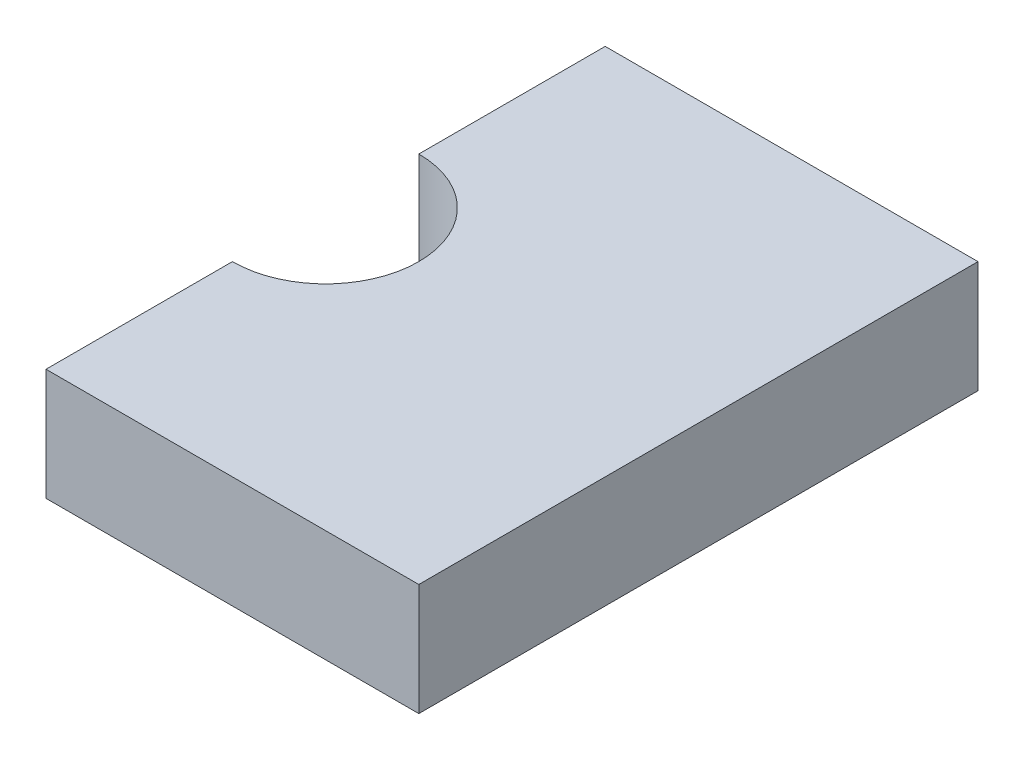
ISO-10303-21;
HEADER;
FILE_DESCRIPTION(('STEP AP214'),'2;1');
FILE_NAME('part.step','',(''),(''),'','','');
FILE_SCHEMA(('AUTOMOTIVE_DESIGN { 1 0 10303 214 1 1 1 1 }'));
ENDSEC;
DATA;
#1=APPLICATION_CONTEXT('core data for automotive mechanical design processes');
#2=APPLICATION_PROTOCOL_DEFINITION('international standard','automotive_design',2000,#1);
#3=PRODUCT_CONTEXT('',#1,'mechanical');
#4=PRODUCT('Part','Part','',(#3));
#5=PRODUCT_RELATED_PRODUCT_CATEGORY('part','',(#4));
#6=PRODUCT_DEFINITION_FORMATION('','',#4);
#7=PRODUCT_DEFINITION_CONTEXT('part definition',#1,'design');
#8=PRODUCT_DEFINITION('design','',#6,#7);
#9=PRODUCT_DEFINITION_SHAPE('','',#8);
#10=(LENGTH_UNIT() NAMED_UNIT(*) SI_UNIT(.MILLI.,.METRE.));
#11=(NAMED_UNIT(*) PLANE_ANGLE_UNIT() SI_UNIT($,.RADIAN.));
#12=(NAMED_UNIT(*) SI_UNIT($,.STERADIAN.) SOLID_ANGLE_UNIT());
#13=UNCERTAINTY_MEASURE_WITH_UNIT(LENGTH_MEASURE(1.E-05),#10,'distance_accuracy_value','');
#14=(GEOMETRIC_REPRESENTATION_CONTEXT(3) GLOBAL_UNCERTAINTY_ASSIGNED_CONTEXT((#13)) GLOBAL_UNIT_ASSIGNED_CONTEXT((#10,
#11,#12)) REPRESENTATION_CONTEXT('',''));
#15=CARTESIAN_POINT('',(0.,0.,0.));
#16=DIRECTION('',(0.,0.,1.));
#17=DIRECTION('',(1.,0.,0.));
#18=AXIS2_PLACEMENT_3D('',#15,#16,#17);
#19=CARTESIAN_POINT('',(0.,3.,0.));
#20=DIRECTION('',(1.,0.,0.));
#21=DIRECTION('',(0.,0.,-1.));
#22=AXIS2_PLACEMENT_3D('',#19,#20,#21);
#23=PLANE('',#22);
#24=DIRECTION('',(0.,0.,1.));
#25=VECTOR('',#24,1.);
#26=CARTESIAN_POINT('',(0.,0.,0.));
#27=LINE('',#26,#25);
#28=CARTESIAN_POINT('',(0.,0.,-5.));
#29=VERTEX_POINT('',#28);
#30=CARTESIAN_POINT('',(0.,0.,0.));
#31=VERTEX_POINT('',#30);
#32=EDGE_CURVE('E118',#29,#31,#27,.T.);
#33=ORIENTED_EDGE('',*,*,#32,.T.);
#34=DIRECTION('',(0.,-1.,0.));
#35=VECTOR('',#34,1.);
#36=CARTESIAN_POINT('',(0.,3.,0.));
#37=LINE('',#36,#35);
#38=CARTESIAN_POINT('',(0.,3.,0.));
#39=VERTEX_POINT('',#38);
#40=EDGE_CURVE('E11',#39,#31,#37,.T.);
#41=ORIENTED_EDGE('',*,*,#40,.F.);
#42=DIRECTION('',(0.,0.,1.));
#43=VECTOR('',#42,1.);
#44=CARTESIAN_POINT('',(0.,3.,0.));
#45=LINE('',#44,#43);
#46=CARTESIAN_POINT('',(0.,3.,-5.));
#47=VERTEX_POINT('',#46);
#48=EDGE_CURVE('E128',#47,#39,#45,.T.);
#49=ORIENTED_EDGE('',*,*,#48,.F.);
#50=DIRECTION('',(0.,-1.,0.));
#51=VECTOR('',#50,1.);
#52=CARTESIAN_POINT('',(0.,3.,-5.));
#53=LINE('',#52,#51);
#54=EDGE_CURVE('E114',#47,#29,#53,.T.);
#55=ORIENTED_EDGE('',*,*,#54,.T.);
#56=EDGE_LOOP('',(#33,#41,#49,#55));
#57=FACE_BOUND('',#56,.T.);
#58=ADVANCED_FACE('F34',(#57),#23,.F.);
#59=CARTESIAN_POINT('',(0.,3.,0.));
#60=DIRECTION('',(0.,0.,-1.));
#61=DIRECTION('',(-1.,0.,0.));
#62=AXIS2_PLACEMENT_3D('',#59,#60,#61);
#63=PLANE('',#62);
#64=DIRECTION('',(1.,0.,0.));
#65=VECTOR('',#64,1.);
#66=CARTESIAN_POINT('',(0.,0.,0.));
#67=LINE('',#66,#65);
#68=CARTESIAN_POINT('',(10.,0.,0.));
#69=VERTEX_POINT('',#68);
#70=EDGE_CURVE('E121',#31,#69,#67,.T.);
#71=ORIENTED_EDGE('',*,*,#70,.T.);
#72=DIRECTION('',(0.,-1.,0.));
#73=VECTOR('',#72,1.);
#74=CARTESIAN_POINT('',(10.,3.,0.));
#75=LINE('',#74,#73);
#76=CARTESIAN_POINT('',(10.,3.,0.));
#77=VERTEX_POINT('',#76);
#78=EDGE_CURVE('E42',#77,#69,#75,.T.);
#79=ORIENTED_EDGE('',*,*,#78,.F.);
#80=DIRECTION('',(1.,0.,0.));
#81=VECTOR('',#80,1.);
#82=CARTESIAN_POINT('',(0.,3.,0.));
#83=LINE('',#82,#81);
#84=EDGE_CURVE('E87',#39,#77,#83,.T.);
#85=ORIENTED_EDGE('',*,*,#84,.F.);
#86=ORIENTED_EDGE('',*,*,#40,.T.);
#87=EDGE_LOOP('',(#71,#79,#85,#86));
#88=FACE_BOUND('',#87,.T.);
#89=ADVANCED_FACE('F152',(#88),#63,.F.);
#90=CARTESIAN_POINT('',(10.,3.,0.));
#91=DIRECTION('',(-1.,0.,0.));
#92=DIRECTION('',(0.,0.,1.));
#93=AXIS2_PLACEMENT_3D('',#90,#91,#92);
#94=PLANE('',#93);
#95=DIRECTION('',(0.,0.,-1.));
#96=VECTOR('',#95,1.);
#97=CARTESIAN_POINT('',(10.,0.,0.));
#98=LINE('',#97,#96);
#99=CARTESIAN_POINT('',(10.,0.,-15.));
#100=VERTEX_POINT('',#99);
#101=EDGE_CURVE('E123',#69,#100,#98,.T.);
#102=ORIENTED_EDGE('',*,*,#101,.T.);
#103=DIRECTION('',(0.,-1.,0.));
#104=VECTOR('',#103,1.);
#105=CARTESIAN_POINT('',(10.,3.,-15.));
#106=LINE('',#105,#104);
#107=CARTESIAN_POINT('',(10.,3.,-15.));
#108=VERTEX_POINT('',#107);
#109=EDGE_CURVE('E109',#108,#100,#106,.T.);
#110=ORIENTED_EDGE('',*,*,#109,.F.);
#111=DIRECTION('',(0.,0.,-1.));
#112=VECTOR('',#111,1.);
#113=CARTESIAN_POINT('',(10.,3.,0.));
#114=LINE('',#113,#112);
#115=EDGE_CURVE('E100',#77,#108,#114,.T.);
#116=ORIENTED_EDGE('',*,*,#115,.F.);
#117=ORIENTED_EDGE('',*,*,#78,.T.);
#118=EDGE_LOOP('',(#102,#110,#116,#117));
#119=FACE_BOUND('',#118,.T.);
#120=ADVANCED_FACE('F134',(#119),#94,.F.);
#121=CARTESIAN_POINT('',(0.,3.,-15.));
#122=DIRECTION('',(0.,0.,1.));
#123=DIRECTION('',(1.,0.,0.));
#124=AXIS2_PLACEMENT_3D('',#121,#122,#123);
#125=PLANE('',#124);
#126=DIRECTION('',(-1.,0.,0.));
#127=VECTOR('',#126,1.);
#128=CARTESIAN_POINT('',(0.,0.,-15.));
#129=LINE('',#128,#127);
#130=CARTESIAN_POINT('',(0.,0.,-15.));
#131=VERTEX_POINT('',#130);
#132=EDGE_CURVE('E108',#100,#131,#129,.T.);
#133=ORIENTED_EDGE('',*,*,#132,.T.);
#134=DIRECTION('',(0.,-1.,0.));
#135=VECTOR('',#134,1.);
#136=CARTESIAN_POINT('',(0.,3.,-15.));
#137=LINE('',#136,#135);
#138=CARTESIAN_POINT('',(0.,3.,-15.));
#139=VERTEX_POINT('',#138);
#140=EDGE_CURVE('E105',#139,#131,#137,.T.);
#141=ORIENTED_EDGE('',*,*,#140,.F.);
#142=DIRECTION('',(-1.,0.,0.));
#143=VECTOR('',#142,1.);
#144=CARTESIAN_POINT('',(0.,3.,-15.));
#145=LINE('',#144,#143);
#146=EDGE_CURVE('E94',#108,#139,#145,.T.);
#147=ORIENTED_EDGE('',*,*,#146,.F.);
#148=ORIENTED_EDGE('',*,*,#109,.T.);
#149=EDGE_LOOP('',(#133,#141,#147,#148));
#150=FACE_BOUND('',#149,.T.);
#151=ADVANCED_FACE('F106',(#150),#125,.F.);
#152=CARTESIAN_POINT('',(0.,3.,-15.));
#153=DIRECTION('',(1.,0.,0.));
#154=DIRECTION('',(0.,0.,-1.));
#155=AXIS2_PLACEMENT_3D('',#152,#153,#154);
#156=PLANE('',#155);
#157=DIRECTION('',(0.,0.,1.));
#158=VECTOR('',#157,1.);
#159=CARTESIAN_POINT('',(0.,0.,-15.));
#160=LINE('',#159,#158);
#161=CARTESIAN_POINT('',(0.,0.,-10.));
#162=VERTEX_POINT('',#161);
#163=EDGE_CURVE('E73',#131,#162,#160,.T.);
#164=ORIENTED_EDGE('',*,*,#163,.T.);
#165=DIRECTION('',(0.,-1.,0.));
#166=VECTOR('',#165,1.);
#167=CARTESIAN_POINT('',(0.,3.,-10.));
#168=LINE('',#167,#166);
#169=CARTESIAN_POINT('',(0.,3.,-10.));
#170=VERTEX_POINT('',#169);
#171=EDGE_CURVE('E110',#170,#162,#168,.T.);
#172=ORIENTED_EDGE('',*,*,#171,.F.);
#173=DIRECTION('',(0.,0.,1.));
#174=VECTOR('',#173,1.);
#175=CARTESIAN_POINT('',(0.,3.,-15.));
#176=LINE('',#175,#174);
#177=EDGE_CURVE('E98',#139,#170,#176,.T.);
#178=ORIENTED_EDGE('',*,*,#177,.F.);
#179=ORIENTED_EDGE('',*,*,#140,.T.);
#180=EDGE_LOOP('',(#164,#172,#178,#179));
#181=FACE_BOUND('',#180,.T.);
#182=ADVANCED_FACE('F112',(#181),#156,.F.);
#183=CARTESIAN_POINT('',(0.,3.,-7.5));
#184=DIRECTION('',(0.,-1.,0.));
#185=DIRECTION('',(0.,0.,-1.));
#186=AXIS2_PLACEMENT_3D('',#183,#184,#185);
#187=CYLINDRICAL_SURFACE('',#186,2.5);
#188=CARTESIAN_POINT('',(0.,0.,-7.5));
#189=DIRECTION('',(0.,-1.,0.));
#190=DIRECTION('',(0.,0.,-1.));
#191=AXIS2_PLACEMENT_3D('',#188,#189,#190);
#192=CIRCLE('',#191,2.5);
#193=EDGE_CURVE('E79',#162,#29,#192,.T.);
#194=ORIENTED_EDGE('',*,*,#193,.T.);
#195=ORIENTED_EDGE('',*,*,#54,.F.);
#196=CARTESIAN_POINT('',(0.,3.,-7.5));
#197=DIRECTION('',(0.,-1.,0.));
#198=DIRECTION('',(0.,0.,-1.));
#199=AXIS2_PLACEMENT_3D('',#196,#197,#198);
#200=CIRCLE('',#199,2.5);
#201=EDGE_CURVE('E50',#170,#47,#200,.T.);
#202=ORIENTED_EDGE('',*,*,#201,.F.);
#203=ORIENTED_EDGE('',*,*,#171,.T.);
#204=EDGE_LOOP('',(#194,#195,#202,#203));
#205=FACE_BOUND('',#204,.T.);
#206=ADVANCED_FACE('F141',(#205),#187,.F.);
#207=CARTESIAN_POINT('',(0.,3.,-7.5));
#208=DIRECTION('',(0.,-1.,0.));
#209=DIRECTION('',(0.,0.,-1.));
#210=AXIS2_PLACEMENT_3D('',#207,#208,#209);
#211=PLANE('',#210);
#212=ORIENTED_EDGE('',*,*,#48,.T.);
#213=ORIENTED_EDGE('',*,*,#84,.T.);
#214=ORIENTED_EDGE('',*,*,#115,.T.);
#215=ORIENTED_EDGE('',*,*,#146,.T.);
#216=ORIENTED_EDGE('',*,*,#177,.T.);
#217=ORIENTED_EDGE('',*,*,#201,.T.);
#218=EDGE_LOOP('',(#212,#213,#214,#215,#216,#217));
#219=FACE_BOUND('',#218,.T.);
#220=ADVANCED_FACE('F96',(#219),#211,.F.);
#221=CARTESIAN_POINT('',(0.,0.,-7.5));
#222=DIRECTION('',(0.,-1.,0.));
#223=DIRECTION('',(0.,0.,-1.));
#224=AXIS2_PLACEMENT_3D('',#221,#222,#223);
#225=PLANE('',#224);
#226=ORIENTED_EDGE('',*,*,#32,.F.);
#227=ORIENTED_EDGE('',*,*,#193,.F.);
#228=ORIENTED_EDGE('',*,*,#163,.F.);
#229=ORIENTED_EDGE('',*,*,#132,.F.);
#230=ORIENTED_EDGE('',*,*,#101,.F.);
#231=ORIENTED_EDGE('',*,*,#70,.F.);
#232=EDGE_LOOP('',(#226,#227,#228,#229,#230,#231));
#233=FACE_BOUND('',#232,.T.);
#234=ADVANCED_FACE('F137',(#233),#225,.T.);
#235=CLOSED_SHELL('',(#58,#89,#120,#151,#182,#206,#220,#234));
#236=MANIFOLD_SOLID_BREP('B2',#235);
#237=ADVANCED_BREP_SHAPE_REPRESENTATION('',(#18,#236),#14);
#238=SHAPE_DEFINITION_REPRESENTATION(#9,#237);
ENDSEC;
END-ISO-10303-21;
